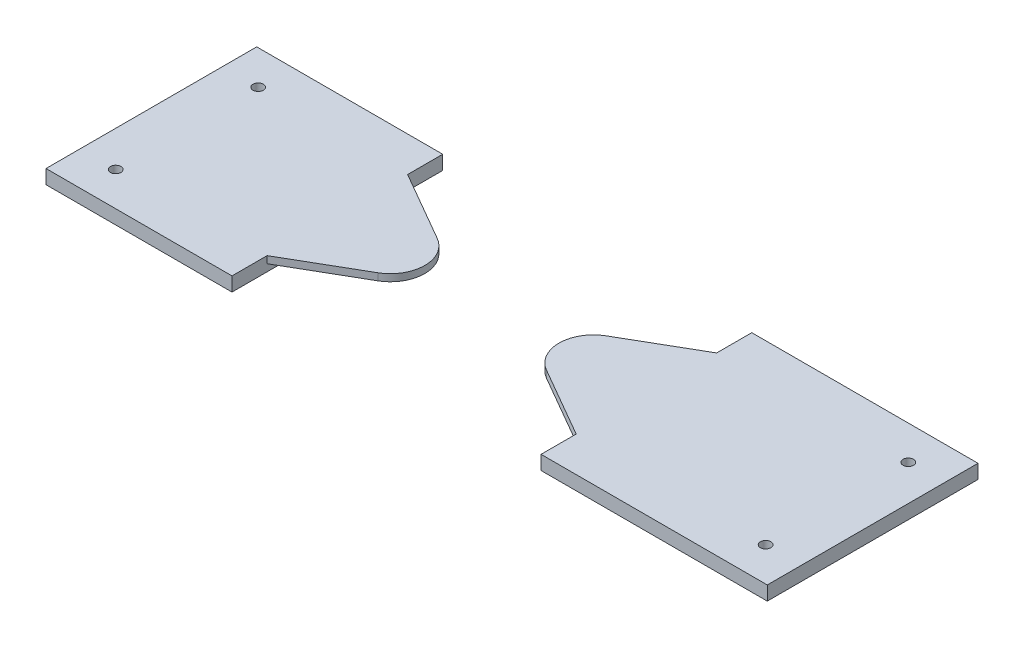
ISO-10303-21;
HEADER;
FILE_DESCRIPTION(('STEP AP214'),'2;1');
FILE_NAME('part.step','',(''),(''),'','','');
FILE_SCHEMA(('AUTOMOTIVE_DESIGN { 1 0 10303 214 1 1 1 1 }'));
ENDSEC;
DATA;
#1=APPLICATION_CONTEXT('core data for automotive mechanical design processes');
#2=APPLICATION_PROTOCOL_DEFINITION('international standard','automotive_design',2000,#1);
#3=PRODUCT_CONTEXT('',#1,'mechanical');
#4=PRODUCT('Part','Part','',(#3));
#5=PRODUCT_RELATED_PRODUCT_CATEGORY('part','',(#4));
#6=PRODUCT_DEFINITION_FORMATION('','',#4);
#7=PRODUCT_DEFINITION_CONTEXT('part definition',#1,'design');
#8=PRODUCT_DEFINITION('design','',#6,#7);
#9=PRODUCT_DEFINITION_SHAPE('','',#8);
#10=(LENGTH_UNIT() NAMED_UNIT(*) SI_UNIT(.MILLI.,.METRE.));
#11=(NAMED_UNIT(*) PLANE_ANGLE_UNIT() SI_UNIT($,.RADIAN.));
#12=(NAMED_UNIT(*) SI_UNIT($,.STERADIAN.) SOLID_ANGLE_UNIT());
#13=UNCERTAINTY_MEASURE_WITH_UNIT(LENGTH_MEASURE(1.E-05),#10,'distance_accuracy_value','');
#14=(GEOMETRIC_REPRESENTATION_CONTEXT(3) GLOBAL_UNCERTAINTY_ASSIGNED_CONTEXT((#13)) GLOBAL_UNIT_ASSIGNED_CONTEXT((#10,
#11,#12)) REPRESENTATION_CONTEXT('',''));
#15=CARTESIAN_POINT('',(0.,0.,0.));
#16=DIRECTION('',(0.,0.,1.));
#17=DIRECTION('',(1.,0.,0.));
#18=AXIS2_PLACEMENT_3D('',#15,#16,#17);
#19=CARTESIAN_POINT('',(-110.,-59.775,0.));
#20=DIRECTION('',(-1.,0.,0.));
#21=DIRECTION('',(0.,0.,1.));
#22=AXIS2_PLACEMENT_3D('',#19,#20,#21);
#23=PLANE('',#22);
#24=DIRECTION('',(0.,1.,0.));
#25=VECTOR('',#24,1.);
#26=CARTESIAN_POINT('',(-110.,17.225,51.6));
#27=LINE('',#26,#25);
#28=CARTESIAN_POINT('',(-110.,17.225,51.6));
#29=VERTEX_POINT('',#28);
#30=CARTESIAN_POINT('',(-110.,22.225,51.6));
#31=VERTEX_POINT('',#30);
#32=EDGE_CURVE('E142',#29,#31,#27,.T.);
#33=ORIENTED_EDGE('',*,*,#32,.F.);
#34=DIRECTION('',(0.,0.,-1.));
#35=VECTOR('',#34,1.);
#36=CARTESIAN_POINT('',(-110.,17.225,0.));
#37=LINE('',#36,#35);
#38=CARTESIAN_POINT('',(-110.,17.225,151.6));
#39=VERTEX_POINT('',#38);
#40=EDGE_CURVE('E156',#39,#29,#37,.T.);
#41=ORIENTED_EDGE('',*,*,#40,.F.);
#42=DIRECTION('',(0.,1.,0.));
#43=VECTOR('',#42,1.);
#44=CARTESIAN_POINT('',(-110.,17.225,151.6));
#45=LINE('',#44,#43);
#46=CARTESIAN_POINT('',(-110.,22.225,151.6));
#47=VERTEX_POINT('',#46);
#48=EDGE_CURVE('E174',#39,#47,#45,.T.);
#49=ORIENTED_EDGE('',*,*,#48,.T.);
#50=DIRECTION('',(0.,0.,1.));
#51=VECTOR('',#50,1.);
#52=CARTESIAN_POINT('',(-110.,22.225,-220.091622966436));
#53=LINE('',#52,#51);
#54=CARTESIAN_POINT('',(-110.,22.225,176.6));
#55=VERTEX_POINT('',#54);
#56=EDGE_CURVE('E181',#47,#55,#53,.T.);
#57=ORIENTED_EDGE('',*,*,#56,.T.);
#58=DIRECTION('',(0.,1.,0.));
#59=VECTOR('',#58,1.);
#60=CARTESIAN_POINT('',(-110.,0.,176.6));
#61=LINE('',#60,#59);
#62=CARTESIAN_POINT('',(-110.,12.225,176.6));
#63=VERTEX_POINT('',#62);
#64=EDGE_CURVE('E189',#63,#55,#61,.T.);
#65=ORIENTED_EDGE('',*,*,#64,.F.);
#66=DIRECTION('',(0.,0.,1.));
#67=VECTOR('',#66,1.);
#68=CARTESIAN_POINT('',(-110.,12.225,26.6));
#69=LINE('',#68,#67);
#70=CARTESIAN_POINT('',(-110.,12.225,26.6));
#71=VERTEX_POINT('',#70);
#72=EDGE_CURVE('E83',#71,#63,#69,.T.);
#73=ORIENTED_EDGE('',*,*,#72,.F.);
#74=DIRECTION('',(0.,1.,0.));
#75=VECTOR('',#74,1.);
#76=CARTESIAN_POINT('',(-110.,0.,26.6));
#77=LINE('',#76,#75);
#78=CARTESIAN_POINT('',(-110.,22.225,26.6));
#79=VERTEX_POINT('',#78);
#80=EDGE_CURVE('E94',#71,#79,#77,.T.);
#81=ORIENTED_EDGE('',*,*,#80,.T.);
#82=EDGE_CURVE('E179',#79,#31,#53,.T.);
#83=ORIENTED_EDGE('',*,*,#82,.T.);
#84=EDGE_LOOP('',(#33,#41,#49,#57,#65,#73,#81,#83));
#85=FACE_BOUND('',#84,.T.);
#86=ADVANCED_FACE('F59',(#85),#23,.F.);
#87=CARTESIAN_POINT('',(143.2,12.225,26.6));
#88=DIRECTION('',(0.,1.,0.));
#89=DIRECTION('',(0.,0.,1.));
#90=AXIS2_PLACEMENT_3D('',#87,#88,#89);
#91=PLANE('',#90);
#92=CARTESIAN_POINT('',(-217.013708212,12.225,50.9666585354133));
#93=DIRECTION('',(0.,1.,0.));
#94=DIRECTION('',(0.,0.,1.));
#95=AXIS2_PLACEMENT_3D('',#92,#93,#94);
#96=CIRCLE('',#95,3.7258);
#97=CARTESIAN_POINT('',(-217.013708212,12.225,54.6924585354133));
#98=VERTEX_POINT('',#97);
#99=EDGE_CURVE('E176',#98,#98,#96,.T.);
#100=ORIENTED_EDGE('',*,*,#99,.T.);
#101=EDGE_LOOP('',(#100));
#102=FACE_BOUND('',#101,.T.);
#103=CARTESIAN_POINT('',(-217.013708212,12.225,152.4));
#104=DIRECTION('',(0.,1.,0.));
#105=DIRECTION('',(0.,0.,1.));
#106=AXIS2_PLACEMENT_3D('',#103,#104,#105);
#107=CIRCLE('',#106,3.7258);
#108=CARTESIAN_POINT('',(-217.013708212,12.225,156.1258));
#109=VERTEX_POINT('',#108);
#110=EDGE_CURVE('E185',#109,#109,#107,.T.);
#111=ORIENTED_EDGE('',*,*,#110,.T.);
#112=EDGE_LOOP('',(#111));
#113=FACE_BOUND('',#112,.T.);
#114=DIRECTION('',(1.,0.,0.));
#115=VECTOR('',#114,1.);
#116=CARTESIAN_POINT('',(-242.41370821,12.225,26.6));
#117=LINE('',#116,#115);
#118=CARTESIAN_POINT('',(-242.41370821,12.225,26.6));
#119=VERTEX_POINT('',#118);
#120=EDGE_CURVE('E118',#119,#71,#117,.T.);
#121=ORIENTED_EDGE('',*,*,#120,.T.);
#122=ORIENTED_EDGE('',*,*,#72,.T.);
#123=DIRECTION('',(1.,0.,0.));
#124=VECTOR('',#123,1.);
#125=CARTESIAN_POINT('',(-242.41370821,12.225,176.6));
#126=LINE('',#125,#124);
#127=CARTESIAN_POINT('',(-242.41370821,12.225,176.6));
#128=VERTEX_POINT('',#127);
#129=EDGE_CURVE('E186',#128,#63,#126,.T.);
#130=ORIENTED_EDGE('',*,*,#129,.F.);
#131=DIRECTION('',(0.,0.,1.));
#132=VECTOR('',#131,1.);
#133=CARTESIAN_POINT('',(-242.41370821,12.225,0.));
#134=LINE('',#133,#132);
#135=EDGE_CURVE('E112',#119,#128,#134,.T.);
#136=ORIENTED_EDGE('',*,*,#135,.F.);
#137=EDGE_LOOP('',(#121,#122,#130,#136));
#138=FACE_BOUND('',#137,.T.);
#139=ADVANCED_FACE('F232',(#102,#113,#138),#91,.F.);
#140=CARTESIAN_POINT('',(-110.,22.225,-220.091622966436));
#141=DIRECTION('',(0.,1.,0.));
#142=DIRECTION('',(0.,0.,1.));
#143=AXIS2_PLACEMENT_3D('',#140,#141,#142);
#144=PLANE('',#143);
#145=CARTESIAN_POINT('',(-217.013708212,22.225,50.9666585354133));
#146=DIRECTION('',(0.,1.,0.));
#147=DIRECTION('',(0.,0.,1.));
#148=AXIS2_PLACEMENT_3D('',#145,#146,#147);
#149=CIRCLE('',#148,3.7258);
#150=CARTESIAN_POINT('',(-217.013708212,22.225,54.6924585354133));
#151=VERTEX_POINT('',#150);
#152=EDGE_CURVE('E199',#151,#151,#149,.T.);
#153=ORIENTED_EDGE('',*,*,#152,.F.);
#154=EDGE_LOOP('',(#153));
#155=FACE_BOUND('',#154,.T.);
#156=CARTESIAN_POINT('',(-217.013708212,22.225,152.4));
#157=DIRECTION('',(0.,1.,0.));
#158=DIRECTION('',(0.,0.,1.));
#159=AXIS2_PLACEMENT_3D('',#156,#157,#158);
#160=CIRCLE('',#159,3.7258);
#161=CARTESIAN_POINT('',(-217.013708212,22.225,156.1258));
#162=VERTEX_POINT('',#161);
#163=EDGE_CURVE('E201',#162,#162,#160,.T.);
#164=ORIENTED_EDGE('',*,*,#163,.F.);
#165=EDGE_LOOP('',(#164));
#166=FACE_BOUND('',#165,.T.);
#167=ORIENTED_EDGE('',*,*,#82,.F.);
#168=DIRECTION('',(1.,0.,0.));
#169=VECTOR('',#168,1.);
#170=CARTESIAN_POINT('',(-242.41370821,22.225,26.6));
#171=LINE('',#170,#169);
#172=CARTESIAN_POINT('',(-242.41370821,22.225,26.6));
#173=VERTEX_POINT('',#172);
#174=EDGE_CURVE('E193',#173,#79,#171,.T.);
#175=ORIENTED_EDGE('',*,*,#174,.F.);
#176=DIRECTION('',(0.,0.,-1.));
#177=VECTOR('',#176,1.);
#178=CARTESIAN_POINT('',(-242.41370821,22.225,0.));
#179=LINE('',#178,#177);
#180=CARTESIAN_POINT('',(-242.41370821,22.225,176.6));
#181=VERTEX_POINT('',#180);
#182=EDGE_CURVE('E105',#181,#173,#179,.T.);
#183=ORIENTED_EDGE('',*,*,#182,.F.);
#184=DIRECTION('',(1.,0.,0.));
#185=VECTOR('',#184,1.);
#186=CARTESIAN_POINT('',(-242.41370821,22.225,176.6));
#187=LINE('',#186,#185);
#188=EDGE_CURVE('E183',#181,#55,#187,.T.);
#189=ORIENTED_EDGE('',*,*,#188,.T.);
#190=ORIENTED_EDGE('',*,*,#56,.F.);
#191=DIRECTION('',(-0.866025403784418,0.,0.500000000000037));
#192=VECTOR('',#191,1.);
#193=CARTESIAN_POINT('',(38.1447256068596,22.225,66.068602791848));
#194=LINE('',#193,#192);
#195=CARTESIAN_POINT('',(-60.000000000001,22.225,122.732486540517));
#196=VERTEX_POINT('',#195);
#197=EDGE_CURVE('E74',#196,#47,#194,.T.);
#198=ORIENTED_EDGE('',*,*,#197,.F.);
#199=CARTESIAN_POINT('',(-72.2008467928145,22.225,101.6));
#200=DIRECTION('',(0.,1.,0.));
#201=DIRECTION('',(0.,0.,1.));
#202=AXIS2_PLACEMENT_3D('',#199,#200,#201);
#203=CIRCLE('',#202,24.4016935856278);
#204=CARTESIAN_POINT('',(-59.9999999999979,22.225,80.467513459483));
#205=VERTEX_POINT('',#204);
#206=EDGE_CURVE('E170',#196,#205,#203,.T.);
#207=ORIENTED_EDGE('',*,*,#206,.T.);
#208=DIRECTION('',(0.866025403784435,0.,0.500000000000006));
#209=VECTOR('',#208,1.);
#210=CARTESIAN_POINT('',(-49.8434554176394,22.225,86.3313972081442));
#211=LINE('',#210,#209);
#212=EDGE_CURVE('E160',#31,#205,#211,.T.);
#213=ORIENTED_EDGE('',*,*,#212,.F.);
#214=EDGE_LOOP('',(#167,#175,#183,#189,#190,#198,#207,#213));
#215=FACE_BOUND('',#214,.T.);
#216=ADVANCED_FACE('F61',(#155,#166,#215),#144,.T.);
#217=CARTESIAN_POINT('',(-242.41370821,0.,26.6));
#218=DIRECTION('',(0.,0.,-1.));
#219=DIRECTION('',(-1.,0.,0.));
#220=AXIS2_PLACEMENT_3D('',#217,#218,#219);
#221=PLANE('',#220);
#222=ORIENTED_EDGE('',*,*,#80,.F.);
#223=ORIENTED_EDGE('',*,*,#120,.F.);
#224=DIRECTION('',(0.,1.,0.));
#225=VECTOR('',#224,1.);
#226=CARTESIAN_POINT('',(-242.41370821,0.,26.6));
#227=LINE('',#226,#225);
#228=EDGE_CURVE('E192',#119,#173,#227,.T.);
#229=ORIENTED_EDGE('',*,*,#228,.T.);
#230=ORIENTED_EDGE('',*,*,#174,.T.);
#231=EDGE_LOOP('',(#222,#223,#229,#230));
#232=FACE_BOUND('',#231,.T.);
#233=ADVANCED_FACE('F255',(#232),#221,.T.);
#234=CARTESIAN_POINT('',(-242.41370821,0.,176.6));
#235=DIRECTION('',(0.,0.,-1.));
#236=DIRECTION('',(-1.,0.,0.));
#237=AXIS2_PLACEMENT_3D('',#234,#235,#236);
#238=PLANE('',#237);
#239=ORIENTED_EDGE('',*,*,#64,.T.);
#240=ORIENTED_EDGE('',*,*,#188,.F.);
#241=DIRECTION('',(0.,1.,0.));
#242=VECTOR('',#241,1.);
#243=CARTESIAN_POINT('',(-242.41370821,0.,176.6));
#244=LINE('',#243,#242);
#245=EDGE_CURVE('E202',#128,#181,#244,.T.);
#246=ORIENTED_EDGE('',*,*,#245,.F.);
#247=ORIENTED_EDGE('',*,*,#129,.T.);
#248=EDGE_LOOP('',(#239,#240,#246,#247));
#249=FACE_BOUND('',#248,.T.);
#250=ADVANCED_FACE('F252',(#249),#238,.F.);
#251=CARTESIAN_POINT('',(-242.41370821,0.,0.));
#252=DIRECTION('',(-1.,0.,0.));
#253=DIRECTION('',(0.,0.,1.));
#254=AXIS2_PLACEMENT_3D('',#251,#252,#253);
#255=PLANE('',#254);
#256=ORIENTED_EDGE('',*,*,#228,.F.);
#257=ORIENTED_EDGE('',*,*,#135,.T.);
#258=ORIENTED_EDGE('',*,*,#245,.T.);
#259=ORIENTED_EDGE('',*,*,#182,.T.);
#260=EDGE_LOOP('',(#256,#257,#258,#259));
#261=FACE_BOUND('',#260,.T.);
#262=ADVANCED_FACE('F248',(#261),#255,.T.);
#263=CARTESIAN_POINT('',(-217.013708212,12.225,152.4));
#264=DIRECTION('',(0.,1.,0.));
#265=DIRECTION('',(0.,0.,1.));
#266=AXIS2_PLACEMENT_3D('',#263,#264,#265);
#267=CYLINDRICAL_SURFACE('',#266,3.7258);
#268=ORIENTED_EDGE('',*,*,#110,.F.);
#269=EDGE_LOOP('',(#268));
#270=FACE_BOUND('',#269,.T.);
#271=ORIENTED_EDGE('',*,*,#163,.T.);
#272=EDGE_LOOP('',(#271));
#273=FACE_BOUND('',#272,.T.);
#274=ADVANCED_FACE('F244',(#270,#273),#267,.F.);
#275=CARTESIAN_POINT('',(-217.013708212,12.225,50.9666585354133));
#276=DIRECTION('',(0.,1.,0.));
#277=DIRECTION('',(0.,0.,1.));
#278=AXIS2_PLACEMENT_3D('',#275,#276,#277);
#279=CYLINDRICAL_SURFACE('',#278,3.7258);
#280=ORIENTED_EDGE('',*,*,#99,.F.);
#281=EDGE_LOOP('',(#280));
#282=FACE_BOUND('',#281,.T.);
#283=ORIENTED_EDGE('',*,*,#152,.T.);
#284=EDGE_LOOP('',(#283));
#285=FACE_BOUND('',#284,.T.);
#286=ADVANCED_FACE('F241',(#282,#285),#279,.F.);
#287=CARTESIAN_POINT('',(38.1447256068596,17.225,66.068602791848));
#288=DIRECTION('',(-0.500000000000037,0.,-0.866025403784418));
#289=DIRECTION('',(-0.866025403784418,0.,0.500000000000037));
#290=AXIS2_PLACEMENT_3D('',#287,#288,#289);
#291=PLANE('',#290);
#292=ORIENTED_EDGE('',*,*,#197,.T.);
#293=ORIENTED_EDGE('',*,*,#48,.F.);
#294=DIRECTION('',(-0.866025403784418,0.,0.500000000000037));
#295=VECTOR('',#294,1.);
#296=CARTESIAN_POINT('',(38.1447256068596,17.225,66.068602791848));
#297=LINE('',#296,#295);
#298=CARTESIAN_POINT('',(-60.000000000001,17.225,122.732486540517));
#299=VERTEX_POINT('',#298);
#300=EDGE_CURVE('E126',#299,#39,#297,.T.);
#301=ORIENTED_EDGE('',*,*,#300,.F.);
#302=DIRECTION('',(0.,1.,0.));
#303=VECTOR('',#302,1.);
#304=CARTESIAN_POINT('',(-60.000000000001,17.225,122.732486540517));
#305=LINE('',#304,#303);
#306=EDGE_CURVE('E149',#299,#196,#305,.T.);
#307=ORIENTED_EDGE('',*,*,#306,.T.);
#308=EDGE_LOOP('',(#292,#293,#301,#307));
#309=FACE_BOUND('',#308,.T.);
#310=ADVANCED_FACE('F243',(#309),#291,.F.);
#311=CARTESIAN_POINT('',(-49.8434554176394,17.225,86.3313972081442));
#312=DIRECTION('',(-0.500000000000006,0.,0.866025403784435));
#313=DIRECTION('',(0.866025403784435,0.,0.500000000000006));
#314=AXIS2_PLACEMENT_3D('',#311,#312,#313);
#315=PLANE('',#314);
#316=ORIENTED_EDGE('',*,*,#212,.T.);
#317=DIRECTION('',(0.,1.,0.));
#318=VECTOR('',#317,1.);
#319=CARTESIAN_POINT('',(-59.9999999999979,17.225,80.467513459483));
#320=LINE('',#319,#318);
#321=CARTESIAN_POINT('',(-59.9999999999979,17.225,80.467513459483));
#322=VERTEX_POINT('',#321);
#323=EDGE_CURVE('E158',#322,#205,#320,.T.);
#324=ORIENTED_EDGE('',*,*,#323,.F.);
#325=DIRECTION('',(0.866025403784435,0.,0.500000000000006));
#326=VECTOR('',#325,1.);
#327=CARTESIAN_POINT('',(-49.8434554176394,17.225,86.3313972081442));
#328=LINE('',#327,#326);
#329=EDGE_CURVE('E151',#29,#322,#328,.T.);
#330=ORIENTED_EDGE('',*,*,#329,.F.);
#331=ORIENTED_EDGE('',*,*,#32,.T.);
#332=EDGE_LOOP('',(#316,#324,#330,#331));
#333=FACE_BOUND('',#332,.T.);
#334=ADVANCED_FACE('F159',(#333),#315,.F.);
#335=CARTESIAN_POINT('',(-72.2008467928145,17.225,101.6));
#336=DIRECTION('',(0.,1.,0.));
#337=DIRECTION('',(0.,0.,1.));
#338=AXIS2_PLACEMENT_3D('',#335,#336,#337);
#339=CYLINDRICAL_SURFACE('',#338,24.4016935856278);
#340=ORIENTED_EDGE('',*,*,#206,.F.);
#341=ORIENTED_EDGE('',*,*,#306,.F.);
#342=CARTESIAN_POINT('',(-72.2008467928145,17.225,101.6));
#343=DIRECTION('',(0.,1.,0.));
#344=DIRECTION('',(0.,0.,1.));
#345=AXIS2_PLACEMENT_3D('',#342,#343,#344);
#346=CIRCLE('',#345,24.4016935856278);
#347=EDGE_CURVE('E154',#299,#322,#346,.T.);
#348=ORIENTED_EDGE('',*,*,#347,.T.);
#349=ORIENTED_EDGE('',*,*,#323,.T.);
#350=EDGE_LOOP('',(#340,#341,#348,#349));
#351=FACE_BOUND('',#350,.T.);
#352=ADVANCED_FACE('F163',(#351),#339,.T.);
#353=CARTESIAN_POINT('',(0.,17.225,0.));
#354=DIRECTION('',(0.,1.,0.));
#355=DIRECTION('',(0.,0.,1.));
#356=AXIS2_PLACEMENT_3D('',#353,#354,#355);
#357=PLANE('',#356);
#358=CARTESIAN_POINT('',(-84.9999999999989,17.225,84.0999999999994));
#359=DIRECTION('',(0.,1.,0.));
#360=DIRECTION('',(0.,0.,1.));
#361=AXIS2_PLACEMENT_3D('',#358,#359,#360);
#362=CIRCLE('',#361,3.75000000000001);
#363=CARTESIAN_POINT('',(-84.9999999999989,17.225,87.8499999999994));
#364=VERTEX_POINT('',#363);
#365=EDGE_CURVE('E13',#364,#364,#362,.F.);
#366=ORIENTED_EDGE('',*,*,#365,.F.);
#367=EDGE_LOOP('',(#366));
#368=FACE_BOUND('',#367,.T.);
#369=CARTESIAN_POINT('',(-84.9999999999989,17.225,119.099999999999));
#370=DIRECTION('',(0.,1.,0.));
#371=DIRECTION('',(0.,0.,1.));
#372=AXIS2_PLACEMENT_3D('',#369,#370,#371);
#373=CIRCLE('',#372,3.75000000000001);
#374=CARTESIAN_POINT('',(-84.9999999999989,17.225,122.849999999999));
#375=VERTEX_POINT('',#374);
#376=EDGE_CURVE('E67',#375,#375,#373,.F.);
#377=ORIENTED_EDGE('',*,*,#376,.F.);
#378=EDGE_LOOP('',(#377));
#379=FACE_BOUND('',#378,.T.);
#380=ORIENTED_EDGE('',*,*,#300,.T.);
#381=ORIENTED_EDGE('',*,*,#40,.T.);
#382=ORIENTED_EDGE('',*,*,#329,.T.);
#383=ORIENTED_EDGE('',*,*,#347,.F.);
#384=EDGE_LOOP('',(#380,#381,#382,#383));
#385=FACE_BOUND('',#384,.T.);
#386=ADVANCED_FACE('F153',(#368,#379,#385),#357,.F.);
#387=CARTESIAN_POINT('',(-84.9999999999989,17.225,119.099999999999));
#388=DIRECTION('',(0.,1.,0.));
#389=DIRECTION('',(0.,0.,1.));
#390=AXIS2_PLACEMENT_3D('',#387,#388,#389);
#391=CONICAL_SURFACE('',#390,3.75000000000001,0.0872664625997167);
#392=CARTESIAN_POINT('',(-84.9999999999989,12.225,119.099999999999));
#393=DIRECTION('',(0.,1.,0.));
#394=DIRECTION('',(0.,0.,1.));
#395=AXIS2_PLACEMENT_3D('',#392,#393,#394);
#396=CIRCLE('',#395,3.31255668237039);
#397=CARTESIAN_POINT('',(-84.9999999999989,12.225,122.41255668237));
#398=VERTEX_POINT('',#397);
#399=EDGE_CURVE('E171',#398,#398,#396,.F.);
#400=ORIENTED_EDGE('',*,*,#399,.F.);
#401=EDGE_LOOP('',(#400));
#402=FACE_BOUND('',#401,.T.);
#403=ORIENTED_EDGE('',*,*,#376,.T.);
#404=EDGE_LOOP('',(#403));
#405=FACE_BOUND('',#404,.T.);
#406=ADVANCED_FACE('F216',(#402,#405),#391,.T.);
#407=CARTESIAN_POINT('',(-84.9999999999989,12.225,119.099999999999));
#408=DIRECTION('',(0.,1.,0.));
#409=DIRECTION('',(0.,0.,1.));
#410=AXIS2_PLACEMENT_3D('',#407,#408,#409);
#411=PLANE('',#410);
#412=ORIENTED_EDGE('',*,*,#399,.T.);
#413=EDGE_LOOP('',(#412));
#414=FACE_BOUND('',#413,.T.);
#415=ADVANCED_FACE('F225',(#414),#411,.F.);
#416=CARTESIAN_POINT('',(-84.9999999999989,17.225,84.0999999999994));
#417=DIRECTION('',(0.,1.,0.));
#418=DIRECTION('',(0.,0.,1.));
#419=AXIS2_PLACEMENT_3D('',#416,#417,#418);
#420=CONICAL_SURFACE('',#419,3.75000000000001,0.0872664625997167);
#421=CARTESIAN_POINT('',(-84.9999999999989,12.225,84.0999999999994));
#422=DIRECTION('',(0.,1.,0.));
#423=DIRECTION('',(0.,0.,1.));
#424=AXIS2_PLACEMENT_3D('',#421,#422,#423);
#425=CIRCLE('',#424,3.31255668237039);
#426=CARTESIAN_POINT('',(-84.9999999999989,12.225,87.4125566823697));
#427=VERTEX_POINT('',#426);
#428=EDGE_CURVE('E315',#427,#427,#425,.F.);
#429=ORIENTED_EDGE('',*,*,#428,.F.);
#430=EDGE_LOOP('',(#429));
#431=FACE_BOUND('',#430,.T.);
#432=ORIENTED_EDGE('',*,*,#365,.T.);
#433=EDGE_LOOP('',(#432));
#434=FACE_BOUND('',#433,.T.);
#435=ADVANCED_FACE('F290',(#431,#434),#420,.T.);
#436=CARTESIAN_POINT('',(-84.9999999999989,12.225,84.0999999999994));
#437=DIRECTION('',(0.,1.,0.));
#438=DIRECTION('',(0.,0.,1.));
#439=AXIS2_PLACEMENT_3D('',#436,#437,#438);
#440=PLANE('',#439);
#441=ORIENTED_EDGE('',*,*,#428,.T.);
#442=EDGE_LOOP('',(#441));
#443=FACE_BOUND('',#442,.T.);
#444=ADVANCED_FACE('F300',(#443),#440,.F.);
#445=CLOSED_SHELL('',(#86,#139,#216,#233,#250,#262,#274,#286,#310,#334,#352,#386,#406,#415,#435,#444));
#446=MANIFOLD_SOLID_BREP('B2',#445);
#447=CARTESIAN_POINT('',(110.,-59.775,0.));
#448=DIRECTION('',(1.,0.,0.));
#449=DIRECTION('',(0.,0.,-1.));
#450=AXIS2_PLACEMENT_3D('',#447,#448,#449);
#451=PLANE('',#450);
#452=DIRECTION('',(0.,1.,0.));
#453=VECTOR('',#452,1.);
#454=CARTESIAN_POINT('',(110.,17.225,151.6));
#455=LINE('',#454,#453);
#456=CARTESIAN_POINT('',(110.,17.225,151.6));
#457=VERTEX_POINT('',#456);
#458=CARTESIAN_POINT('',(110.,22.225,151.6));
#459=VERTEX_POINT('',#458);
#460=EDGE_CURVE('E540',#457,#459,#455,.T.);
#461=ORIENTED_EDGE('',*,*,#460,.F.);
#462=DIRECTION('',(0.,0.,1.));
#463=VECTOR('',#462,1.);
#464=CARTESIAN_POINT('',(110.,17.225,0.));
#465=LINE('',#464,#463);
#466=CARTESIAN_POINT('',(110.,17.225,51.6));
#467=VERTEX_POINT('',#466);
#468=EDGE_CURVE('E536',#467,#457,#465,.T.);
#469=ORIENTED_EDGE('',*,*,#468,.F.);
#470=DIRECTION('',(0.,1.,0.));
#471=VECTOR('',#470,1.);
#472=CARTESIAN_POINT('',(110.,17.225,51.6));
#473=LINE('',#472,#471);
#474=CARTESIAN_POINT('',(110.,22.225,51.6));
#475=VERTEX_POINT('',#474);
#476=EDGE_CURVE('E531',#467,#475,#473,.T.);
#477=ORIENTED_EDGE('',*,*,#476,.T.);
#478=DIRECTION('',(0.,0.,-1.));
#479=VECTOR('',#478,1.);
#480=CARTESIAN_POINT('',(110.,22.225,-220.091622966436));
#481=LINE('',#480,#479);
#482=CARTESIAN_POINT('',(110.,22.225,26.6));
#483=VERTEX_POINT('',#482);
#484=EDGE_CURVE('E428',#475,#483,#481,.T.);
#485=ORIENTED_EDGE('',*,*,#484,.T.);
#486=DIRECTION('',(0.,1.,0.));
#487=VECTOR('',#486,1.);
#488=CARTESIAN_POINT('',(110.,12.225,26.6));
#489=LINE('',#488,#487);
#490=CARTESIAN_POINT('',(110.,12.225,26.6));
#491=VERTEX_POINT('',#490);
#492=EDGE_CURVE('E475',#491,#483,#489,.T.);
#493=ORIENTED_EDGE('',*,*,#492,.F.);
#494=DIRECTION('',(0.,0.,-1.));
#495=VECTOR('',#494,1.);
#496=CARTESIAN_POINT('',(110.,12.225,26.6));
#497=LINE('',#496,#495);
#498=CARTESIAN_POINT('',(110.,12.225,176.6));
#499=VERTEX_POINT('',#498);
#500=EDGE_CURVE('E437',#499,#491,#497,.T.);
#501=ORIENTED_EDGE('',*,*,#500,.F.);
#502=DIRECTION('',(0.,-1.,0.));
#503=VECTOR('',#502,1.);
#504=CARTESIAN_POINT('',(110.,12.225,176.6));
#505=LINE('',#504,#503);
#506=CARTESIAN_POINT('',(110.,22.225,176.6));
#507=VERTEX_POINT('',#506);
#508=EDGE_CURVE('E471',#507,#499,#505,.T.);
#509=ORIENTED_EDGE('',*,*,#508,.F.);
#510=EDGE_CURVE('E488',#507,#459,#481,.T.);
#511=ORIENTED_EDGE('',*,*,#510,.T.);
#512=EDGE_LOOP('',(#461,#469,#477,#485,#493,#501,#509,#511));
#513=FACE_BOUND('',#512,.T.);
#514=ADVANCED_FACE('F391',(#513),#451,.F.);
#515=CARTESIAN_POINT('',(245.647291788,12.225,50.7999999999998));
#516=DIRECTION('',(0.,1.,0.));
#517=DIRECTION('',(0.,0.,1.));
#518=AXIS2_PLACEMENT_3D('',#515,#516,#517);
#519=CYLINDRICAL_SURFACE('',#518,3.7258);
#520=CARTESIAN_POINT('',(245.647291788,12.225,50.7999999999998));
#521=DIRECTION('',(0.,1.,0.));
#522=DIRECTION('',(0.,0.,1.));
#523=AXIS2_PLACEMENT_3D('',#520,#521,#522);
#524=CIRCLE('',#523,3.7258);
#525=CARTESIAN_POINT('',(245.647291788,12.225,54.5257999999998));
#526=VERTEX_POINT('',#525);
#527=EDGE_CURVE('E562',#526,#526,#524,.T.);
#528=ORIENTED_EDGE('',*,*,#527,.F.);
#529=EDGE_LOOP('',(#528));
#530=FACE_BOUND('',#529,.T.);
#531=CARTESIAN_POINT('',(245.647291788,22.225,50.7999999999998));
#532=DIRECTION('',(0.,1.,0.));
#533=DIRECTION('',(0.,0.,1.));
#534=AXIS2_PLACEMENT_3D('',#531,#532,#533);
#535=CIRCLE('',#534,3.7258);
#536=CARTESIAN_POINT('',(245.647291788,22.225,54.5257999999998));
#537=VERTEX_POINT('',#536);
#538=EDGE_CURVE('E476',#537,#537,#535,.T.);
#539=ORIENTED_EDGE('',*,*,#538,.T.);
#540=EDGE_LOOP('',(#539));
#541=FACE_BOUND('',#540,.T.);
#542=ADVANCED_FACE('F580',(#530,#541),#519,.F.);
#543=CARTESIAN_POINT('',(245.647291788,12.225,152.4));
#544=DIRECTION('',(0.,1.,0.));
#545=DIRECTION('',(0.,0.,1.));
#546=AXIS2_PLACEMENT_3D('',#543,#544,#545);
#547=CYLINDRICAL_SURFACE('',#546,3.7258);
#548=CARTESIAN_POINT('',(245.647291788,12.225,152.4));
#549=DIRECTION('',(0.,1.,0.));
#550=DIRECTION('',(0.,0.,1.));
#551=AXIS2_PLACEMENT_3D('',#548,#549,#550);
#552=CIRCLE('',#551,3.7258);
#553=CARTESIAN_POINT('',(245.647291788,12.225,156.1258));
#554=VERTEX_POINT('',#553);
#555=EDGE_CURVE('E530',#554,#554,#552,.T.);
#556=ORIENTED_EDGE('',*,*,#555,.F.);
#557=EDGE_LOOP('',(#556));
#558=FACE_BOUND('',#557,.T.);
#559=CARTESIAN_POINT('',(245.647291788,22.225,152.4));
#560=DIRECTION('',(0.,1.,0.));
#561=DIRECTION('',(0.,0.,1.));
#562=AXIS2_PLACEMENT_3D('',#559,#560,#561);
#563=CIRCLE('',#562,3.7258);
#564=CARTESIAN_POINT('',(245.647291788,22.225,156.1258));
#565=VERTEX_POINT('',#564);
#566=EDGE_CURVE('E566',#565,#565,#563,.T.);
#567=ORIENTED_EDGE('',*,*,#566,.T.);
#568=EDGE_LOOP('',(#567));
#569=FACE_BOUND('',#568,.T.);
#570=ADVANCED_FACE('F577',(#558,#569),#547,.F.);
#571=CARTESIAN_POINT('',(271.04729179,2.23048741239811E-13,0.));
#572=DIRECTION('',(-1.,0.,0.));
#573=DIRECTION('',(0.,-1.,0.));
#574=AXIS2_PLACEMENT_3D('',#571,#572,#573);
#575=PLANE('',#574);
#576=DIRECTION('',(0.,-1.,0.));
#577=VECTOR('',#576,1.);
#578=CARTESIAN_POINT('',(271.04729179,12.2250000000001,176.6));
#579=LINE('',#578,#577);
#580=CARTESIAN_POINT('',(271.04729179,22.2250000000001,176.6));
#581=VERTEX_POINT('',#580);
#582=CARTESIAN_POINT('',(271.04729179,12.2250000000001,176.6));
#583=VERTEX_POINT('',#582);
#584=EDGE_CURVE('E450',#581,#583,#579,.T.);
#585=ORIENTED_EDGE('',*,*,#584,.T.);
#586=DIRECTION('',(0.,0.,-1.));
#587=VECTOR('',#586,1.);
#588=CARTESIAN_POINT('',(271.04729179,12.2250000000001,176.6));
#589=LINE('',#588,#587);
#590=CARTESIAN_POINT('',(271.04729179,12.2250000000001,26.6));
#591=VERTEX_POINT('',#590);
#592=EDGE_CURVE('E443',#583,#591,#589,.T.);
#593=ORIENTED_EDGE('',*,*,#592,.T.);
#594=DIRECTION('',(0.,1.,0.));
#595=VECTOR('',#594,1.);
#596=CARTESIAN_POINT('',(271.04729179,12.2250000000001,26.6));
#597=LINE('',#596,#595);
#598=CARTESIAN_POINT('',(271.04729179,22.2250000000001,26.6));
#599=VERTEX_POINT('',#598);
#600=EDGE_CURVE('E447',#591,#599,#597,.T.);
#601=ORIENTED_EDGE('',*,*,#600,.T.);
#602=DIRECTION('',(0.,0.,1.));
#603=VECTOR('',#602,1.);
#604=CARTESIAN_POINT('',(271.04729179,22.2250000000001,176.6));
#605=LINE('',#604,#603);
#606=EDGE_CURVE('E416',#599,#581,#605,.T.);
#607=ORIENTED_EDGE('',*,*,#606,.T.);
#608=EDGE_LOOP('',(#585,#593,#601,#607));
#609=FACE_BOUND('',#608,.T.);
#610=ADVANCED_FACE('F445',(#609),#575,.F.);
#611=CARTESIAN_POINT('',(271.04729179,12.2250000000001,26.6));
#612=DIRECTION('',(0.,0.,1.));
#613=DIRECTION('',(1.,0.,0.));
#614=AXIS2_PLACEMENT_3D('',#611,#612,#613);
#615=PLANE('',#614);
#616=ORIENTED_EDGE('',*,*,#492,.T.);
#617=DIRECTION('',(-1.,0.,0.));
#618=VECTOR('',#617,1.);
#619=CARTESIAN_POINT('',(271.04729179,22.2250000000001,26.6));
#620=LINE('',#619,#618);
#621=EDGE_CURVE('E460',#599,#483,#620,.T.);
#622=ORIENTED_EDGE('',*,*,#621,.F.);
#623=ORIENTED_EDGE('',*,*,#600,.F.);
#624=DIRECTION('',(-1.,0.,0.));
#625=VECTOR('',#624,1.);
#626=CARTESIAN_POINT('',(271.04729179,12.2250000000001,26.6));
#627=LINE('',#626,#625);
#628=EDGE_CURVE('E456',#591,#491,#627,.T.);
#629=ORIENTED_EDGE('',*,*,#628,.T.);
#630=EDGE_LOOP('',(#616,#622,#623,#629));
#631=FACE_BOUND('',#630,.T.);
#632=ADVANCED_FACE('F462',(#631),#615,.F.);
#633=CARTESIAN_POINT('',(271.04729179,12.2250000000001,176.6));
#634=DIRECTION('',(0.,0.,-1.));
#635=DIRECTION('',(-1.,0.,0.));
#636=AXIS2_PLACEMENT_3D('',#633,#634,#635);
#637=PLANE('',#636);
#638=ORIENTED_EDGE('',*,*,#508,.T.);
#639=DIRECTION('',(-1.,0.,0.));
#640=VECTOR('',#639,1.);
#641=CARTESIAN_POINT('',(271.04729179,12.2250000000001,176.6));
#642=LINE('',#641,#640);
#643=EDGE_CURVE('E459',#583,#499,#642,.T.);
#644=ORIENTED_EDGE('',*,*,#643,.F.);
#645=ORIENTED_EDGE('',*,*,#584,.F.);
#646=DIRECTION('',(-1.,0.,0.));
#647=VECTOR('',#646,1.);
#648=CARTESIAN_POINT('',(271.04729179,22.2250000000001,176.6));
#649=LINE('',#648,#647);
#650=EDGE_CURVE('E467',#581,#507,#649,.T.);
#651=ORIENTED_EDGE('',*,*,#650,.T.);
#652=EDGE_LOOP('',(#638,#644,#645,#651));
#653=FACE_BOUND('',#652,.T.);
#654=ADVANCED_FACE('F594',(#653),#637,.F.);
#655=CARTESIAN_POINT('',(143.2,12.225,26.6));
#656=DIRECTION('',(0.,1.,0.));
#657=DIRECTION('',(0.,0.,1.));
#658=AXIS2_PLACEMENT_3D('',#655,#656,#657);
#659=PLANE('',#658);
#660=ORIENTED_EDGE('',*,*,#555,.T.);
#661=EDGE_LOOP('',(#660));
#662=FACE_BOUND('',#661,.T.);
#663=ORIENTED_EDGE('',*,*,#527,.T.);
#664=EDGE_LOOP('',(#663));
#665=FACE_BOUND('',#664,.T.);
#666=ORIENTED_EDGE('',*,*,#643,.T.);
#667=ORIENTED_EDGE('',*,*,#500,.T.);
#668=ORIENTED_EDGE('',*,*,#628,.F.);
#669=ORIENTED_EDGE('',*,*,#592,.F.);
#670=EDGE_LOOP('',(#666,#667,#668,#669));
#671=FACE_BOUND('',#670,.T.);
#672=ADVANCED_FACE('F393',(#662,#665,#671),#659,.F.);
#673=CARTESIAN_POINT('',(-110.,22.225,-220.091622966436));
#674=DIRECTION('',(0.,1.,0.));
#675=DIRECTION('',(0.,0.,1.));
#676=AXIS2_PLACEMENT_3D('',#673,#674,#675);
#677=PLANE('',#676);
#678=ORIENTED_EDGE('',*,*,#566,.F.);
#679=EDGE_LOOP('',(#678));
#680=FACE_BOUND('',#679,.T.);
#681=ORIENTED_EDGE('',*,*,#538,.F.);
#682=EDGE_LOOP('',(#681));
#683=FACE_BOUND('',#682,.T.);
#684=ORIENTED_EDGE('',*,*,#510,.F.);
#685=ORIENTED_EDGE('',*,*,#650,.F.);
#686=ORIENTED_EDGE('',*,*,#606,.F.);
#687=ORIENTED_EDGE('',*,*,#621,.T.);
#688=ORIENTED_EDGE('',*,*,#484,.F.);
#689=DIRECTION('',(-0.866025403784434,0.,0.500000000000008));
#690=VECTOR('',#689,1.);
#691=CARTESIAN_POINT('',(49.8434554176396,22.225,86.3313972081442));
#692=LINE('',#691,#690);
#693=CARTESIAN_POINT('',(60.0000000000008,22.225,80.4675134594814));
#694=VERTEX_POINT('',#693);
#695=EDGE_CURVE('E407',#475,#694,#692,.T.);
#696=ORIENTED_EDGE('',*,*,#695,.T.);
#697=CARTESIAN_POINT('',(72.2008467928145,22.225,101.6));
#698=DIRECTION('',(0.,1.,0.));
#699=DIRECTION('',(0.,0.,1.));
#700=AXIS2_PLACEMENT_3D('',#697,#698,#699);
#701=CIRCLE('',#700,24.4016935856276);
#702=CARTESIAN_POINT('',(60.0000000000011,22.225,122.732486540516));
#703=VERTEX_POINT('',#702);
#704=EDGE_CURVE('E528',#703,#694,#701,.F.);
#705=ORIENTED_EDGE('',*,*,#704,.F.);
#706=DIRECTION('',(0.866025403784415,0.,0.500000000000041));
#707=VECTOR('',#706,1.);
#708=CARTESIAN_POINT('',(-38.1447256068596,22.225,66.0686027918472));
#709=LINE('',#708,#707);
#710=EDGE_CURVE('E547',#703,#459,#709,.T.);
#711=ORIENTED_EDGE('',*,*,#710,.T.);
#712=EDGE_LOOP('',(#684,#685,#686,#687,#688,#696,#705,#711));
#713=FACE_BOUND('',#712,.T.);
#714=ADVANCED_FACE('F584',(#680,#683,#713),#677,.T.);
#715=CARTESIAN_POINT('',(72.2008467928145,17.225,101.6));
#716=DIRECTION('',(0.,1.,0.));
#717=DIRECTION('',(0.,0.,1.));
#718=AXIS2_PLACEMENT_3D('',#715,#716,#717);
#719=CYLINDRICAL_SURFACE('',#718,24.4016935856276);
#720=ORIENTED_EDGE('',*,*,#704,.T.);
#721=DIRECTION('',(0.,1.,0.));
#722=VECTOR('',#721,1.);
#723=CARTESIAN_POINT('',(60.0000000000008,17.225,80.4675134594814));
#724=LINE('',#723,#722);
#725=CARTESIAN_POINT('',(60.0000000000008,17.225,80.4675134594814));
#726=VERTEX_POINT('',#725);
#727=EDGE_CURVE('E524',#726,#694,#724,.T.);
#728=ORIENTED_EDGE('',*,*,#727,.F.);
#729=CARTESIAN_POINT('',(72.2008467928145,17.225,101.6));
#730=DIRECTION('',(0.,1.,0.));
#731=DIRECTION('',(0.,0.,1.));
#732=AXIS2_PLACEMENT_3D('',#729,#730,#731);
#733=CIRCLE('',#732,24.4016935856276);
#734=CARTESIAN_POINT('',(60.0000000000011,17.225,122.732486540516));
#735=VERTEX_POINT('',#734);
#736=EDGE_CURVE('E508',#735,#726,#733,.F.);
#737=ORIENTED_EDGE('',*,*,#736,.F.);
#738=DIRECTION('',(0.,1.,0.));
#739=VECTOR('',#738,1.);
#740=CARTESIAN_POINT('',(60.0000000000011,17.225,122.732486540516));
#741=LINE('',#740,#739);
#742=EDGE_CURVE('E535',#735,#703,#741,.T.);
#743=ORIENTED_EDGE('',*,*,#742,.T.);
#744=EDGE_LOOP('',(#720,#728,#737,#743));
#745=FACE_BOUND('',#744,.T.);
#746=ADVANCED_FACE('F525',(#745),#719,.T.);
#747=CARTESIAN_POINT('',(49.8434554176396,17.225,86.3313972081442));
#748=DIRECTION('',(-0.500000000000008,0.,-0.866025403784434));
#749=DIRECTION('',(-0.866025403784434,0.,0.500000000000008));
#750=AXIS2_PLACEMENT_3D('',#747,#748,#749);
#751=PLANE('',#750);
#752=ORIENTED_EDGE('',*,*,#695,.F.);
#753=ORIENTED_EDGE('',*,*,#476,.F.);
#754=DIRECTION('',(-0.866025403784434,0.,0.500000000000008));
#755=VECTOR('',#754,1.);
#756=CARTESIAN_POINT('',(49.8434554176396,17.225,86.3313972081442));
#757=LINE('',#756,#755);
#758=EDGE_CURVE('E513',#467,#726,#757,.T.);
#759=ORIENTED_EDGE('',*,*,#758,.T.);
#760=ORIENTED_EDGE('',*,*,#727,.T.);
#761=EDGE_LOOP('',(#752,#753,#759,#760));
#762=FACE_BOUND('',#761,.T.);
#763=ADVANCED_FACE('F533',(#762),#751,.T.);
#764=CARTESIAN_POINT('',(-38.1447256068596,17.225,66.0686027918472));
#765=DIRECTION('',(-0.500000000000041,0.,0.866025403784415));
#766=DIRECTION('',(0.866025403784415,0.,0.500000000000041));
#767=AXIS2_PLACEMENT_3D('',#764,#765,#766);
#768=PLANE('',#767);
#769=ORIENTED_EDGE('',*,*,#710,.F.);
#770=ORIENTED_EDGE('',*,*,#742,.F.);
#771=DIRECTION('',(0.866025403784415,0.,0.500000000000041));
#772=VECTOR('',#771,1.);
#773=CARTESIAN_POINT('',(-38.1447256068596,17.225,66.0686027918472));
#774=LINE('',#773,#772);
#775=EDGE_CURVE('E517',#735,#457,#774,.T.);
#776=ORIENTED_EDGE('',*,*,#775,.T.);
#777=ORIENTED_EDGE('',*,*,#460,.T.);
#778=EDGE_LOOP('',(#769,#770,#776,#777));
#779=FACE_BOUND('',#778,.T.);
#780=ADVANCED_FACE('F500',(#779),#768,.T.);
#781=CARTESIAN_POINT('',(0.,17.225,0.));
#782=DIRECTION('',(0.,1.,0.));
#783=DIRECTION('',(0.,0.,1.));
#784=AXIS2_PLACEMENT_3D('',#781,#782,#783);
#785=PLANE('',#784);
#786=CARTESIAN_POINT('',(84.9999999999989,17.225,84.0999999999994));
#787=DIRECTION('',(0.,1.,0.));
#788=DIRECTION('',(0.,0.,1.));
#789=AXIS2_PLACEMENT_3D('',#786,#787,#788);
#790=CIRCLE('',#789,3.75000000000001);
#791=CARTESIAN_POINT('',(84.9999999999989,17.225,87.8499999999994));
#792=VERTEX_POINT('',#791);
#793=EDGE_CURVE('E57',#792,#792,#790,.F.);
#794=ORIENTED_EDGE('',*,*,#793,.F.);
#795=EDGE_LOOP('',(#794));
#796=FACE_BOUND('',#795,.T.);
#797=CARTESIAN_POINT('',(84.9999999999989,17.225,119.099999999999));
#798=DIRECTION('',(0.,1.,0.));
#799=DIRECTION('',(0.,0.,1.));
#800=AXIS2_PLACEMENT_3D('',#797,#798,#799);
#801=CIRCLE('',#800,3.75000000000001);
#802=CARTESIAN_POINT('',(84.9999999999989,17.225,122.849999999999));
#803=VERTEX_POINT('',#802);
#804=EDGE_CURVE('E400',#803,#803,#801,.F.);
#805=ORIENTED_EDGE('',*,*,#804,.F.);
#806=EDGE_LOOP('',(#805));
#807=FACE_BOUND('',#806,.T.);
#808=ORIENTED_EDGE('',*,*,#736,.T.);
#809=ORIENTED_EDGE('',*,*,#758,.F.);
#810=ORIENTED_EDGE('',*,*,#468,.T.);
#811=ORIENTED_EDGE('',*,*,#775,.F.);
#812=EDGE_LOOP('',(#808,#809,#810,#811));
#813=FACE_BOUND('',#812,.T.);
#814=ADVANCED_FACE('F497',(#796,#807,#813),#785,.F.);
#815=CARTESIAN_POINT('',(84.9999999999989,17.225,119.099999999999));
#816=DIRECTION('',(0.,1.,0.));
#817=DIRECTION('',(0.,0.,-1.));
#818=AXIS2_PLACEMENT_3D('',#815,#816,#817);
#819=CONICAL_SURFACE('',#818,3.75000000000001,0.0872664625997167);
#820=CARTESIAN_POINT('',(84.9999999999989,12.225,119.099999999999));
#821=DIRECTION('',(0.,-1.,0.));
#822=DIRECTION('',(0.,0.,-1.));
#823=AXIS2_PLACEMENT_3D('',#820,#821,#822);
#824=CIRCLE('',#823,3.31255668237039);
#825=CARTESIAN_POINT('',(84.9999999999989,12.225,115.787443317629));
#826=VERTEX_POINT('',#825);
#827=EDGE_CURVE('E548',#826,#826,#824,.T.);
#828=ORIENTED_EDGE('',*,*,#827,.F.);
#829=EDGE_LOOP('',(#828));
#830=FACE_BOUND('',#829,.T.);
#831=ORIENTED_EDGE('',*,*,#804,.T.);
#832=EDGE_LOOP('',(#831));
#833=FACE_BOUND('',#832,.T.);
#834=ADVANCED_FACE('F495',(#830,#833),#819,.T.);
#835=CARTESIAN_POINT('',(84.9999999999989,12.225,119.099999999999));
#836=DIRECTION('',(0.,-1.,0.));
#837=DIRECTION('',(0.,0.,-1.));
#838=AXIS2_PLACEMENT_3D('',#835,#836,#837);
#839=PLANE('',#838);
#840=ORIENTED_EDGE('',*,*,#827,.T.);
#841=EDGE_LOOP('',(#840));
#842=FACE_BOUND('',#841,.T.);
#843=ADVANCED_FACE('F680',(#842),#839,.T.);
#844=CARTESIAN_POINT('',(84.9999999999989,17.225,84.0999999999994));
#845=DIRECTION('',(0.,1.,0.));
#846=DIRECTION('',(0.,0.,-1.));
#847=AXIS2_PLACEMENT_3D('',#844,#845,#846);
#848=CONICAL_SURFACE('',#847,3.75000000000001,0.0872664625997167);
#849=CARTESIAN_POINT('',(84.9999999999989,12.225,84.0999999999994));
#850=DIRECTION('',(0.,-1.,0.));
#851=DIRECTION('',(0.,0.,-1.));
#852=AXIS2_PLACEMENT_3D('',#849,#850,#851);
#853=CIRCLE('',#852,3.31255668237039);
#854=CARTESIAN_POINT('',(84.9999999999989,12.225,80.787443317629));
#855=VERTEX_POINT('',#854);
#856=EDGE_CURVE('E721',#855,#855,#853,.T.);
#857=ORIENTED_EDGE('',*,*,#856,.F.);
#858=EDGE_LOOP('',(#857));
#859=FACE_BOUND('',#858,.T.);
#860=ORIENTED_EDGE('',*,*,#793,.T.);
#861=EDGE_LOOP('',(#860));
#862=FACE_BOUND('',#861,.T.);
#863=ADVANCED_FACE('F689',(#859,#862),#848,.T.);
#864=CARTESIAN_POINT('',(84.9999999999989,12.225,84.0999999999994));
#865=DIRECTION('',(0.,-1.,0.));
#866=DIRECTION('',(0.,0.,-1.));
#867=AXIS2_PLACEMENT_3D('',#864,#865,#866);
#868=PLANE('',#867);
#869=ORIENTED_EDGE('',*,*,#856,.T.);
#870=EDGE_LOOP('',(#869));
#871=FACE_BOUND('',#870,.T.);
#872=ADVANCED_FACE('F698',(#871),#868,.T.);
#873=CLOSED_SHELL('',(#514,#542,#570,#610,#632,#654,#672,#714,#746,#763,#780,#814,#834,#843,
#863,#872));
#874=MANIFOLD_SOLID_BREP('B7',#873);
#875=ADVANCED_BREP_SHAPE_REPRESENTATION('',(#18,#446,#874),#14);
#876=SHAPE_DEFINITION_REPRESENTATION(#9,#875);
ENDSEC;
END-ISO-10303-21;
